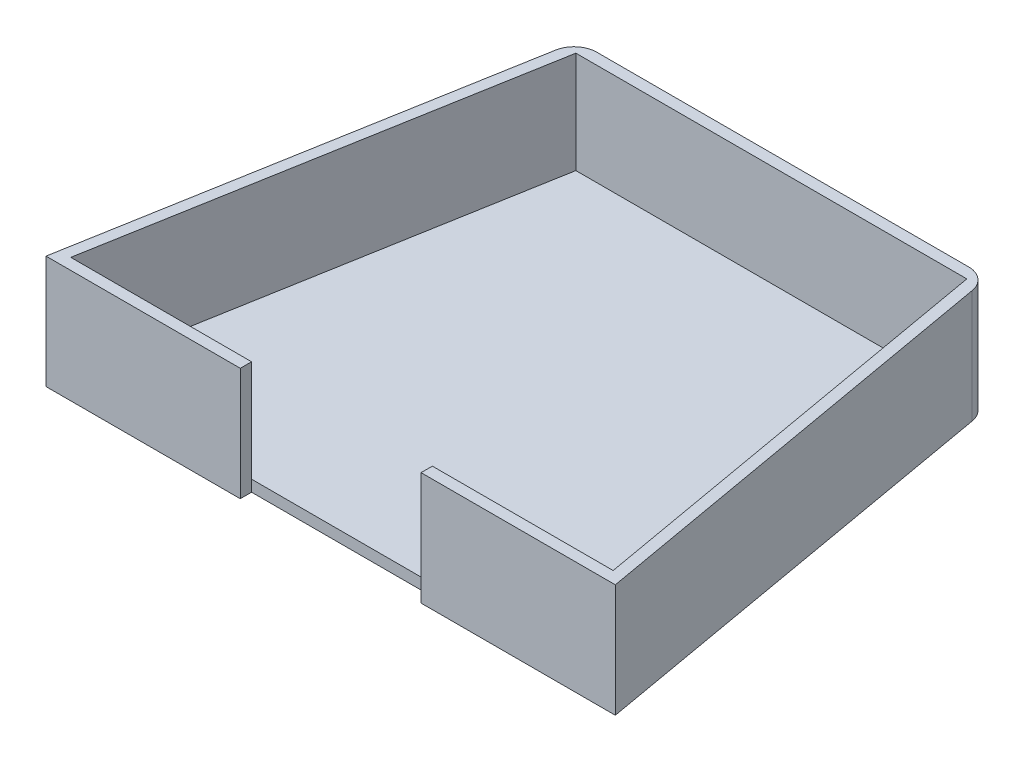
ISO-10303-21;
HEADER;
FILE_DESCRIPTION(('STEP AP214'),'2;1');
FILE_NAME('part.step','',(''),(''),'','','');
FILE_SCHEMA(('AUTOMOTIVE_DESIGN { 1 0 10303 214 1 1 1 1 }'));
ENDSEC;
DATA;
#1=APPLICATION_CONTEXT('core data for automotive mechanical design processes');
#2=APPLICATION_PROTOCOL_DEFINITION('international standard','automotive_design',2000,#1);
#3=PRODUCT_CONTEXT('',#1,'mechanical');
#4=PRODUCT('Part','Part','',(#3));
#5=PRODUCT_RELATED_PRODUCT_CATEGORY('part','',(#4));
#6=PRODUCT_DEFINITION_FORMATION('','',#4);
#7=PRODUCT_DEFINITION_CONTEXT('part definition',#1,'design');
#8=PRODUCT_DEFINITION('design','',#6,#7);
#9=PRODUCT_DEFINITION_SHAPE('','',#8);
#10=(LENGTH_UNIT() NAMED_UNIT(*) SI_UNIT(.MILLI.,.METRE.));
#11=(NAMED_UNIT(*) PLANE_ANGLE_UNIT() SI_UNIT($,.RADIAN.));
#12=(NAMED_UNIT(*) SI_UNIT($,.STERADIAN.) SOLID_ANGLE_UNIT());
#13=UNCERTAINTY_MEASURE_WITH_UNIT(LENGTH_MEASURE(1.E-05),#10,'distance_accuracy_value','');
#14=(GEOMETRIC_REPRESENTATION_CONTEXT(3) GLOBAL_UNCERTAINTY_ASSIGNED_CONTEXT((#13)) GLOBAL_UNIT_ASSIGNED_CONTEXT((#10,
#11,#12)) REPRESENTATION_CONTEXT('',''));
#15=CARTESIAN_POINT('',(0.,0.,0.));
#16=DIRECTION('',(0.,0.,1.));
#17=DIRECTION('',(1.,0.,0.));
#18=AXIS2_PLACEMENT_3D('',#15,#16,#17);
#19=CARTESIAN_POINT('',(240.,5.,0.));
#20=DIRECTION('',(0.,0.,-1.));
#21=DIRECTION('',(-1.,0.,0.));
#22=AXIS2_PLACEMENT_3D('',#19,#20,#21);
#23=PLANE('',#22);
#24=DIRECTION('',(0.,-1.,0.));
#25=VECTOR('',#24,1.);
#26=CARTESIAN_POINT('',(240.,5.,0.));
#27=LINE('',#26,#25);
#28=CARTESIAN_POINT('',(240.,5.,0.));
#29=VERTEX_POINT('',#28);
#30=CARTESIAN_POINT('',(240.,0.,0.));
#31=VERTEX_POINT('',#30);
#32=EDGE_CURVE('E13',#29,#31,#27,.T.);
#33=ORIENTED_EDGE('',*,*,#32,.F.);
#34=DIRECTION('',(1.,0.,0.));
#35=VECTOR('',#34,1.);
#36=CARTESIAN_POINT('',(240.,5.,0.));
#37=LINE('',#36,#35);
#38=CARTESIAN_POINT('',(0.,5.,0.));
#39=VERTEX_POINT('',#38);
#40=EDGE_CURVE('E123',#39,#29,#37,.T.);
#41=ORIENTED_EDGE('',*,*,#40,.F.);
#42=DIRECTION('',(0.,-1.,0.));
#43=VECTOR('',#42,1.);
#44=CARTESIAN_POINT('',(0.,5.,0.));
#45=LINE('',#44,#43);
#46=CARTESIAN_POINT('',(0.,0.,0.));
#47=VERTEX_POINT('',#46);
#48=EDGE_CURVE('E143',#39,#47,#45,.T.);
#49=ORIENTED_EDGE('',*,*,#48,.T.);
#50=DIRECTION('',(1.,0.,0.));
#51=VECTOR('',#50,1.);
#52=CARTESIAN_POINT('',(240.,0.,0.));
#53=LINE('',#52,#51);
#54=EDGE_CURVE('E147',#47,#31,#53,.T.);
#55=ORIENTED_EDGE('',*,*,#54,.T.);
#56=EDGE_LOOP('',(#33,#41,#49,#55));
#57=FACE_BOUND('',#56,.T.);
#58=ADVANCED_FACE('F78',(#57),#23,.F.);
#59=CARTESIAN_POINT('',(206.497873665391,5.,-190.));
#60=DIRECTION('',(-0.984807753012207,0.,0.173648177666935));
#61=DIRECTION('',(0.173648177666935,0.,0.984807753012207));
#62=AXIS2_PLACEMENT_3D('',#59,#60,#61);
#63=PLANE('',#62);
#64=DIRECTION('',(-0.173648177666935,0.,-0.984807753012207));
#65=VECTOR('',#64,1.);
#66=CARTESIAN_POINT('',(206.497873665391,0.,-190.));
#67=LINE('',#66,#65);
#68=CARTESIAN_POINT('',(206.497873665391,0.,-190.));
#69=VERTEX_POINT('',#68);
#70=EDGE_CURVE('E136',#31,#69,#67,.T.);
#71=ORIENTED_EDGE('',*,*,#70,.T.);
#72=DIRECTION('',(0.,-1.,0.));
#73=VECTOR('',#72,1.);
#74=CARTESIAN_POINT('',(206.497873665391,5.,-190.));
#75=LINE('',#74,#73);
#76=CARTESIAN_POINT('',(206.497873665391,5.,-190.));
#77=VERTEX_POINT('',#76);
#78=EDGE_CURVE('E87',#77,#69,#75,.T.);
#79=ORIENTED_EDGE('',*,*,#78,.F.);
#80=DIRECTION('',(-0.173648177666935,0.,-0.984807753012207));
#81=VECTOR('',#80,1.);
#82=CARTESIAN_POINT('',(206.497873665391,5.,-190.));
#83=LINE('',#82,#81);
#84=EDGE_CURVE('E125',#29,#77,#83,.T.);
#85=ORIENTED_EDGE('',*,*,#84,.F.);
#86=ORIENTED_EDGE('',*,*,#32,.T.);
#87=EDGE_LOOP('',(#71,#79,#85,#86));
#88=FACE_BOUND('',#87,.T.);
#89=ADVANCED_FACE('F134',(#88),#63,.F.);
#90=CARTESIAN_POINT('',(33.5021263346091,5.,-190.));
#91=DIRECTION('',(0.,0.,1.));
#92=DIRECTION('',(1.,0.,0.));
#93=AXIS2_PLACEMENT_3D('',#90,#91,#92);
#94=PLANE('',#93);
#95=DIRECTION('',(-1.,0.,0.));
#96=VECTOR('',#95,1.);
#97=CARTESIAN_POINT('',(33.5021263346091,0.,-190.));
#98=LINE('',#97,#96);
#99=CARTESIAN_POINT('',(33.5021263346091,0.,-190.));
#100=VERTEX_POINT('',#99);
#101=EDGE_CURVE('E112',#69,#100,#98,.T.);
#102=ORIENTED_EDGE('',*,*,#101,.T.);
#103=DIRECTION('',(0.,-1.,0.));
#104=VECTOR('',#103,1.);
#105=CARTESIAN_POINT('',(33.5021263346091,5.,-190.));
#106=LINE('',#105,#104);
#107=CARTESIAN_POINT('',(33.5021263346091,5.,-190.));
#108=VERTEX_POINT('',#107);
#109=EDGE_CURVE('E138',#108,#100,#106,.T.);
#110=ORIENTED_EDGE('',*,*,#109,.F.);
#111=DIRECTION('',(-1.,0.,0.));
#112=VECTOR('',#111,1.);
#113=CARTESIAN_POINT('',(33.5021263346091,5.,-190.));
#114=LINE('',#113,#112);
#115=EDGE_CURVE('E129',#77,#108,#114,.T.);
#116=ORIENTED_EDGE('',*,*,#115,.F.);
#117=ORIENTED_EDGE('',*,*,#78,.T.);
#118=EDGE_LOOP('',(#102,#110,#116,#117));
#119=FACE_BOUND('',#118,.T.);
#120=ADVANCED_FACE('F139',(#119),#94,.F.);
#121=CARTESIAN_POINT('',(0.,5.,0.));
#122=DIRECTION('',(0.984807753012207,0.,0.173648177666934));
#123=DIRECTION('',(0.173648177666934,0.,-0.984807753012208));
#124=AXIS2_PLACEMENT_3D('',#121,#122,#123);
#125=PLANE('',#124);
#126=DIRECTION('',(-0.173648177666934,0.,0.984807753012207));
#127=VECTOR('',#126,1.);
#128=CARTESIAN_POINT('',(0.,0.,0.));
#129=LINE('',#128,#127);
#130=EDGE_CURVE('E118',#100,#47,#129,.T.);
#131=ORIENTED_EDGE('',*,*,#130,.T.);
#132=ORIENTED_EDGE('',*,*,#48,.F.);
#133=DIRECTION('',(-0.173648177666934,0.,0.984807753012207));
#134=VECTOR('',#133,1.);
#135=CARTESIAN_POINT('',(0.,5.,0.));
#136=LINE('',#135,#134);
#137=EDGE_CURVE('E95',#108,#39,#136,.T.);
#138=ORIENTED_EDGE('',*,*,#137,.F.);
#139=ORIENTED_EDGE('',*,*,#109,.T.);
#140=EDGE_LOOP('',(#131,#132,#138,#139));
#141=FACE_BOUND('',#140,.T.);
#142=ADVANCED_FACE('F159',(#141),#125,.F.);
#143=CARTESIAN_POINT('',(0.,5.,0.));
#144=DIRECTION('',(0.,-1.,0.));
#145=DIRECTION('',(0.,0.,-1.));
#146=AXIS2_PLACEMENT_3D('',#143,#144,#145);
#147=PLANE('',#146);
#148=ORIENTED_EDGE('',*,*,#40,.T.);
#149=ORIENTED_EDGE('',*,*,#84,.T.);
#150=ORIENTED_EDGE('',*,*,#115,.T.);
#151=ORIENTED_EDGE('',*,*,#137,.T.);
#152=EDGE_LOOP('',(#148,#149,#150,#151));
#153=FACE_BOUND('',#152,.T.);
#154=ADVANCED_FACE('F127',(#153),#147,.F.);
#155=CARTESIAN_POINT('',(0.,0.,0.));
#156=DIRECTION('',(0.,-1.,0.));
#157=DIRECTION('',(0.,0.,-1.));
#158=AXIS2_PLACEMENT_3D('',#155,#156,#157);
#159=PLANE('',#158);
#160=ORIENTED_EDGE('',*,*,#54,.F.);
#161=ORIENTED_EDGE('',*,*,#130,.F.);
#162=ORIENTED_EDGE('',*,*,#101,.F.);
#163=ORIENTED_EDGE('',*,*,#70,.F.);
#164=EDGE_LOOP('',(#160,#161,#162,#163));
#165=FACE_BOUND('',#164,.T.);
#166=ADVANCED_FACE('F162',(#165),#159,.T.);
#167=CLOSED_SHELL('',(#58,#89,#120,#142,#154,#166));
#168=MANIFOLD_SOLID_BREP('B2',#167);
#169=CARTESIAN_POINT('',(0.,50.,5.));
#170=DIRECTION('',(0.,0.,1.));
#171=DIRECTION('',(1.,0.,0.));
#172=AXIS2_PLACEMENT_3D('',#169,#170,#171);
#173=PLANE('',#172);
#174=DIRECTION('',(-1.,0.,0.));
#175=VECTOR('',#174,1.);
#176=CARTESIAN_POINT('',(0.,50.,5.));
#177=LINE('',#176,#175);
#178=CARTESIAN_POINT('',(245.958767962971,50.,4.99999999999998));
#179=VERTEX_POINT('',#178);
#180=CARTESIAN_POINT('',(160.,50.,5.));
#181=VERTEX_POINT('',#180);
#182=EDGE_CURVE('E356',#179,#181,#177,.T.);
#183=ORIENTED_EDGE('',*,*,#182,.T.);
#184=DIRECTION('',(0.,-1.,0.));
#185=VECTOR('',#184,1.);
#186=CARTESIAN_POINT('',(160.,0.,5.));
#187=LINE('',#186,#185);
#188=CARTESIAN_POINT('',(160.,0.,5.));
#189=VERTEX_POINT('',#188);
#190=EDGE_CURVE('E412',#181,#189,#187,.T.);
#191=ORIENTED_EDGE('',*,*,#190,.T.);
#192=DIRECTION('',(-1.,0.,0.));
#193=VECTOR('',#192,1.);
#194=CARTESIAN_POINT('',(0.,0.,5.));
#195=LINE('',#194,#193);
#196=CARTESIAN_POINT('',(245.958767962971,0.,4.99999999999998));
#197=VERTEX_POINT('',#196);
#198=EDGE_CURVE('E324',#197,#189,#195,.T.);
#199=ORIENTED_EDGE('',*,*,#198,.F.);
#200=DIRECTION('',(0.,-1.,0.));
#201=VECTOR('',#200,1.);
#202=CARTESIAN_POINT('',(245.958767962971,50.,4.99999999999998));
#203=LINE('',#202,#201);
#204=EDGE_CURVE('E365',#179,#197,#203,.T.);
#205=ORIENTED_EDGE('',*,*,#204,.F.);
#206=EDGE_LOOP('',(#183,#191,#199,#205));
#207=FACE_BOUND('',#206,.T.);
#208=ADVANCED_FACE('F207',(#207),#173,.T.);
#209=CARTESIAN_POINT('',(240.,50.,0.));
#210=DIRECTION('',(0.,0.,1.));
#211=DIRECTION('',(1.,0.,0.));
#212=AXIS2_PLACEMENT_3D('',#209,#210,#211);
#213=PLANE('',#212);
#214=DIRECTION('',(0.,-1.,0.));
#215=VECTOR('',#214,1.);
#216=CARTESIAN_POINT('',(160.,0.,0.));
#217=LINE('',#216,#215);
#218=CARTESIAN_POINT('',(160.,50.,0.));
#219=VERTEX_POINT('',#218);
#220=CARTESIAN_POINT('',(160.,0.,0.));
#221=VERTEX_POINT('',#220);
#222=EDGE_CURVE('E305',#219,#221,#217,.T.);
#223=ORIENTED_EDGE('',*,*,#222,.F.);
#224=DIRECTION('',(-1.,0.,0.));
#225=VECTOR('',#224,1.);
#226=CARTESIAN_POINT('',(240.,50.,0.));
#227=LINE('',#226,#225);
#228=CARTESIAN_POINT('',(240.,50.,0.));
#229=VERTEX_POINT('',#228);
#230=EDGE_CURVE('E424',#229,#219,#227,.T.);
#231=ORIENTED_EDGE('',*,*,#230,.F.);
#232=DIRECTION('',(0.,-1.,0.));
#233=VECTOR('',#232,1.);
#234=CARTESIAN_POINT('',(240.,50.,0.));
#235=LINE('',#234,#233);
#236=CARTESIAN_POINT('',(240.,0.,0.));
#237=VERTEX_POINT('',#236);
#238=EDGE_CURVE('E328',#229,#237,#235,.T.);
#239=ORIENTED_EDGE('',*,*,#238,.T.);
#240=DIRECTION('',(-1.,0.,0.));
#241=VECTOR('',#240,1.);
#242=CARTESIAN_POINT('',(240.,0.,0.));
#243=LINE('',#242,#241);
#244=EDGE_CURVE('E322',#237,#221,#243,.T.);
#245=ORIENTED_EDGE('',*,*,#244,.T.);
#246=EDGE_LOOP('',(#223,#231,#239,#245));
#247=FACE_BOUND('',#246,.T.);
#248=ADVANCED_FACE('F327',(#247),#213,.F.);
#249=CARTESIAN_POINT('',(237.68715325937,50.,-41.9106580874159));
#250=DIRECTION('',(0.984807753012207,0.,-0.173648177666935));
#251=DIRECTION('',(-0.173648177666935,0.,-0.984807753012207));
#252=AXIS2_PLACEMENT_3D('',#249,#250,#251);
#253=PLANE('',#252);
#254=DIRECTION('',(0.173648177666935,0.,0.984807753012207));
#255=VECTOR('',#254,1.);
#256=CARTESIAN_POINT('',(237.68715325937,0.,-41.9106580874159));
#257=LINE('',#256,#255);
#258=CARTESIAN_POINT('',(212.150453039626,0.,-186.736481776669));
#259=VERTEX_POINT('',#258);
#260=EDGE_CURVE('E344',#259,#197,#257,.T.);
#261=ORIENTED_EDGE('',*,*,#260,.F.);
#262=DIRECTION('',(0.,-1.,0.));
#263=VECTOR('',#262,1.);
#264=CARTESIAN_POINT('',(212.150453039626,50.,-186.736481776669));
#265=LINE('',#264,#263);
#266=CARTESIAN_POINT('',(212.150453039626,50.,-186.736481776669));
#267=VERTEX_POINT('',#266);
#268=EDGE_CURVE('E388',#259,#267,#265,.F.);
#269=ORIENTED_EDGE('',*,*,#268,.T.);
#270=DIRECTION('',(0.173648177666935,0.,0.984807753012207));
#271=VECTOR('',#270,1.);
#272=CARTESIAN_POINT('',(237.68715325937,50.,-41.9106580874159));
#273=LINE('',#272,#271);
#274=EDGE_CURVE('E352',#267,#179,#273,.T.);
#275=ORIENTED_EDGE('',*,*,#274,.T.);
#276=ORIENTED_EDGE('',*,*,#204,.T.);
#277=EDGE_LOOP('',(#261,#269,#275,#276));
#278=FACE_BOUND('',#277,.T.);
#279=ADVANCED_FACE('F409',(#278),#253,.T.);
#280=CARTESIAN_POINT('',(0.,50.,-195.));
#281=DIRECTION('',(0.,0.,-1.));
#282=DIRECTION('',(-1.,0.,0.));
#283=AXIS2_PLACEMENT_3D('',#280,#281,#282);
#284=PLANE('',#283);
#285=DIRECTION('',(1.,0.,0.));
#286=VECTOR('',#285,1.);
#287=CARTESIAN_POINT('',(0.,50.,-195.));
#288=LINE('',#287,#286);
#289=CARTESIAN_POINT('',(37.6976244904955,50.,-195.));
#290=VERTEX_POINT('',#289);
#291=CARTESIAN_POINT('',(202.302375509504,50.,-195.));
#292=VERTEX_POINT('',#291);
#293=EDGE_CURVE('E362',#290,#292,#288,.T.);
#294=ORIENTED_EDGE('',*,*,#293,.T.);
#295=DIRECTION('',(0.,-1.,0.));
#296=VECTOR('',#295,1.);
#297=CARTESIAN_POINT('',(202.302375509504,50.,-195.));
#298=LINE('',#297,#296);
#299=CARTESIAN_POINT('',(202.302375509504,0.,-195.));
#300=VERTEX_POINT('',#299);
#301=EDGE_CURVE('E381',#292,#300,#298,.T.);
#302=ORIENTED_EDGE('',*,*,#301,.T.);
#303=DIRECTION('',(1.,0.,0.));
#304=VECTOR('',#303,1.);
#305=CARTESIAN_POINT('',(0.,0.,-195.));
#306=LINE('',#305,#304);
#307=CARTESIAN_POINT('',(37.6976244904955,0.,-195.));
#308=VERTEX_POINT('',#307);
#309=EDGE_CURVE('E355',#308,#300,#306,.T.);
#310=ORIENTED_EDGE('',*,*,#309,.F.);
#311=DIRECTION('',(0.,-1.,0.));
#312=VECTOR('',#311,1.);
#313=CARTESIAN_POINT('',(37.6976244904955,50.,-195.));
#314=LINE('',#313,#312);
#315=EDGE_CURVE('E377',#308,#290,#314,.F.);
#316=ORIENTED_EDGE('',*,*,#315,.T.);
#317=EDGE_LOOP('',(#294,#302,#310,#316));
#318=FACE_BOUND('',#317,.T.);
#319=ADVANCED_FACE('F403',(#318),#284,.T.);
#320=CARTESIAN_POINT('',(-4.92403876506104,50.,-0.868240888334671));
#321=DIRECTION('',(-0.984807753012207,0.,-0.173648177666934));
#322=DIRECTION('',(-0.173648177666934,0.,0.984807753012207));
#323=AXIS2_PLACEMENT_3D('',#320,#321,#322);
#324=PLANE('',#323);
#325=DIRECTION('',(0.173648177666934,0.,-0.984807753012208));
#326=VECTOR('',#325,1.);
#327=CARTESIAN_POINT('',(-4.92403876506104,50.,-0.868240888334671));
#328=LINE('',#327,#326);
#329=CARTESIAN_POINT('',(-5.95876796297107,50.,5.));
#330=VERTEX_POINT('',#329);
#331=CARTESIAN_POINT('',(27.8495469603734,50.,-186.736481776669));
#332=VERTEX_POINT('',#331);
#333=EDGE_CURVE('E359',#330,#332,#328,.T.);
#334=ORIENTED_EDGE('',*,*,#333,.T.);
#335=DIRECTION('',(0.,-1.,0.));
#336=VECTOR('',#335,1.);
#337=CARTESIAN_POINT('',(27.8495469603734,50.,-186.736481776669));
#338=LINE('',#337,#336);
#339=CARTESIAN_POINT('',(27.8495469603734,0.,-186.736481776669));
#340=VERTEX_POINT('',#339);
#341=EDGE_CURVE('E76',#332,#340,#338,.T.);
#342=ORIENTED_EDGE('',*,*,#341,.T.);
#343=DIRECTION('',(0.173648177666934,0.,-0.984807753012208));
#344=VECTOR('',#343,1.);
#345=CARTESIAN_POINT('',(-4.92403876506104,0.,-0.868240888334671));
#346=LINE('',#345,#344);
#347=CARTESIAN_POINT('',(-5.95876796297107,0.,5.));
#348=VERTEX_POINT('',#347);
#349=EDGE_CURVE('E369',#348,#340,#346,.T.);
#350=ORIENTED_EDGE('',*,*,#349,.F.);
#351=DIRECTION('',(0.,-1.,0.));
#352=VECTOR('',#351,1.);
#353=CARTESIAN_POINT('',(-5.95876796297107,50.,5.));
#354=LINE('',#353,#352);
#355=EDGE_CURVE('E374',#330,#348,#354,.T.);
#356=ORIENTED_EDGE('',*,*,#355,.F.);
#357=EDGE_LOOP('',(#334,#342,#350,#356));
#358=FACE_BOUND('',#357,.T.);
#359=ADVANCED_FACE('F455',(#358),#324,.T.);
#360=DIRECTION('',(0.,-1.,0.));
#361=VECTOR('',#360,1.);
#362=CARTESIAN_POINT('',(80.,0.,5.));
#363=LINE('',#362,#361);
#364=CARTESIAN_POINT('',(80.,50.,5.));
#365=VERTEX_POINT('',#364);
#366=CARTESIAN_POINT('',(80.,0.,5.));
#367=VERTEX_POINT('',#366);
#368=EDGE_CURVE('E315',#365,#367,#363,.T.);
#369=ORIENTED_EDGE('',*,*,#368,.F.);
#370=EDGE_CURVE('E354',#365,#330,#177,.T.);
#371=ORIENTED_EDGE('',*,*,#370,.T.);
#372=ORIENTED_EDGE('',*,*,#355,.T.);
#373=EDGE_CURVE('E367',#367,#348,#195,.T.);
#374=ORIENTED_EDGE('',*,*,#373,.F.);
#375=EDGE_LOOP('',(#369,#371,#372,#374));
#376=FACE_BOUND('',#375,.T.);
#377=ADVANCED_FACE('F451',(#376),#173,.T.);
#378=CARTESIAN_POINT('',(0.,50.,0.));
#379=DIRECTION('',(0.,-1.,0.));
#380=DIRECTION('',(0.,0.,-1.));
#381=AXIS2_PLACEMENT_3D('',#378,#379,#380);
#382=PLANE('',#381);
#383=ORIENTED_EDGE('',*,*,#370,.F.);
#384=DIRECTION('',(0.,0.,1.));
#385=VECTOR('',#384,1.);
#386=CARTESIAN_POINT('',(80.,50.,0.));
#387=LINE('',#386,#385);
#388=CARTESIAN_POINT('',(80.,50.,0.));
#389=VERTEX_POINT('',#388);
#390=EDGE_CURVE('E418',#389,#365,#387,.T.);
#391=ORIENTED_EDGE('',*,*,#390,.F.);
#392=CARTESIAN_POINT('',(0.,50.,0.));
#393=VERTEX_POINT('',#392);
#394=EDGE_CURVE('E423',#389,#393,#227,.T.);
#395=ORIENTED_EDGE('',*,*,#394,.T.);
#396=DIRECTION('',(0.173648177666934,0.,-0.984807753012207));
#397=VECTOR('',#396,1.);
#398=CARTESIAN_POINT('',(0.,50.,0.));
#399=LINE('',#398,#397);
#400=CARTESIAN_POINT('',(33.5021263346091,50.,-190.));
#401=VERTEX_POINT('',#400);
#402=EDGE_CURVE('E426',#393,#401,#399,.T.);
#403=ORIENTED_EDGE('',*,*,#402,.T.);
#404=DIRECTION('',(1.,0.,0.));
#405=VECTOR('',#404,1.);
#406=CARTESIAN_POINT('',(33.5021263346091,50.,-190.));
#407=LINE('',#406,#405);
#408=CARTESIAN_POINT('',(206.497873665391,50.,-190.));
#409=VERTEX_POINT('',#408);
#410=EDGE_CURVE('E351',#401,#409,#407,.T.);
#411=ORIENTED_EDGE('',*,*,#410,.T.);
#412=DIRECTION('',(0.173648177666935,0.,0.984807753012207));
#413=VECTOR('',#412,1.);
#414=CARTESIAN_POINT('',(206.497873665391,50.,-190.));
#415=LINE('',#414,#413);
#416=EDGE_CURVE('E341',#409,#229,#415,.T.);
#417=ORIENTED_EDGE('',*,*,#416,.T.);
#418=ORIENTED_EDGE('',*,*,#230,.T.);
#419=DIRECTION('',(0.,0.,1.));
#420=VECTOR('',#419,1.);
#421=CARTESIAN_POINT('',(160.,50.,0.));
#422=LINE('',#421,#420);
#423=EDGE_CURVE('E222',#219,#181,#422,.T.);
#424=ORIENTED_EDGE('',*,*,#423,.T.);
#425=ORIENTED_EDGE('',*,*,#182,.F.);
#426=ORIENTED_EDGE('',*,*,#274,.F.);
#427=CARTESIAN_POINT('',(202.302375509504,50.,-185.));
#428=DIRECTION('',(0.,-1.,0.));
#429=DIRECTION('',(0.,0.,-1.));
#430=AXIS2_PLACEMENT_3D('',#427,#428,#429);
#431=CIRCLE('',#430,10.);
#432=EDGE_CURVE('E215',#267,#292,#431,.F.);
#433=ORIENTED_EDGE('',*,*,#432,.T.);
#434=ORIENTED_EDGE('',*,*,#293,.F.);
#435=CARTESIAN_POINT('',(37.6976244904955,50.,-185.));
#436=DIRECTION('',(0.,-1.,0.));
#437=DIRECTION('',(0.,0.,-1.));
#438=AXIS2_PLACEMENT_3D('',#435,#436,#437);
#439=CIRCLE('',#438,10.);
#440=EDGE_CURVE('E390',#290,#332,#439,.F.);
#441=ORIENTED_EDGE('',*,*,#440,.T.);
#442=ORIENTED_EDGE('',*,*,#333,.F.);
#443=EDGE_LOOP('',(#383,#391,#395,#403,#411,#417,#418,#424,#425,#426,#433,#434,#441,#442));
#444=FACE_BOUND('',#443,.T.);
#445=ADVANCED_FACE('F396',(#444),#382,.F.);
#446=CARTESIAN_POINT('',(0.,0.,0.));
#447=DIRECTION('',(0.,-1.,0.));
#448=DIRECTION('',(0.,0.,-1.));
#449=AXIS2_PLACEMENT_3D('',#446,#447,#448);
#450=PLANE('',#449);
#451=DIRECTION('',(0.,0.,1.));
#452=VECTOR('',#451,1.);
#453=CARTESIAN_POINT('',(80.,0.,0.));
#454=LINE('',#453,#452);
#455=CARTESIAN_POINT('',(80.,0.,0.));
#456=VERTEX_POINT('',#455);
#457=EDGE_CURVE('E230',#456,#367,#454,.T.);
#458=ORIENTED_EDGE('',*,*,#457,.T.);
#459=ORIENTED_EDGE('',*,*,#373,.T.);
#460=ORIENTED_EDGE('',*,*,#349,.T.);
#461=CARTESIAN_POINT('',(37.6976244904955,0.,-185.));
#462=DIRECTION('',(0.,-1.,0.));
#463=DIRECTION('',(0.,0.,-1.));
#464=AXIS2_PLACEMENT_3D('',#461,#462,#463);
#465=CIRCLE('',#464,10.);
#466=EDGE_CURVE('E384',#340,#308,#465,.T.);
#467=ORIENTED_EDGE('',*,*,#466,.T.);
#468=ORIENTED_EDGE('',*,*,#309,.T.);
#469=CARTESIAN_POINT('',(202.302375509504,0.,-185.));
#470=DIRECTION('',(0.,-1.,0.));
#471=DIRECTION('',(0.,0.,-1.));
#472=AXIS2_PLACEMENT_3D('',#469,#470,#471);
#473=CIRCLE('',#472,10.);
#474=EDGE_CURVE('E386',#300,#259,#473,.T.);
#475=ORIENTED_EDGE('',*,*,#474,.T.);
#476=ORIENTED_EDGE('',*,*,#260,.T.);
#477=ORIENTED_EDGE('',*,*,#198,.T.);
#478=DIRECTION('',(0.,0.,1.));
#479=VECTOR('',#478,1.);
#480=CARTESIAN_POINT('',(160.,0.,0.));
#481=LINE('',#480,#479);
#482=EDGE_CURVE('E308',#221,#189,#481,.T.);
#483=ORIENTED_EDGE('',*,*,#482,.F.);
#484=ORIENTED_EDGE('',*,*,#244,.F.);
#485=DIRECTION('',(0.173648177666935,0.,0.984807753012207));
#486=VECTOR('',#485,1.);
#487=CARTESIAN_POINT('',(206.497873665391,0.,-190.));
#488=LINE('',#487,#486);
#489=CARTESIAN_POINT('',(206.497873665391,0.,-190.));
#490=VERTEX_POINT('',#489);
#491=EDGE_CURVE('E335',#490,#237,#488,.T.);
#492=ORIENTED_EDGE('',*,*,#491,.F.);
#493=DIRECTION('',(1.,0.,0.));
#494=VECTOR('',#493,1.);
#495=CARTESIAN_POINT('',(33.5021263346091,0.,-190.));
#496=LINE('',#495,#494);
#497=CARTESIAN_POINT('',(33.5021263346091,0.,-190.));
#498=VERTEX_POINT('',#497);
#499=EDGE_CURVE('E333',#498,#490,#496,.T.);
#500=ORIENTED_EDGE('',*,*,#499,.F.);
#501=DIRECTION('',(0.173648177666934,0.,-0.984807753012207));
#502=VECTOR('',#501,1.);
#503=CARTESIAN_POINT('',(0.,0.,0.));
#504=LINE('',#503,#502);
#505=CARTESIAN_POINT('',(0.,0.,0.));
#506=VERTEX_POINT('',#505);
#507=EDGE_CURVE('E329',#506,#498,#504,.T.);
#508=ORIENTED_EDGE('',*,*,#507,.F.);
#509=EDGE_CURVE('E330',#456,#506,#243,.T.);
#510=ORIENTED_EDGE('',*,*,#509,.F.);
#511=EDGE_LOOP('',(#458,#459,#460,#467,#468,#475,#476,#477,#483,#484,#492,#500,#508,#510));
#512=FACE_BOUND('',#511,.T.);
#513=ADVANCED_FACE('F320',(#512),#450,.T.);
#514=CARTESIAN_POINT('',(206.497873665391,50.,-190.));
#515=DIRECTION('',(0.984807753012207,0.,-0.173648177666935));
#516=DIRECTION('',(-0.173648177666935,0.,-0.984807753012207));
#517=AXIS2_PLACEMENT_3D('',#514,#515,#516);
#518=PLANE('',#517);
#519=ORIENTED_EDGE('',*,*,#491,.T.);
#520=ORIENTED_EDGE('',*,*,#238,.F.);
#521=ORIENTED_EDGE('',*,*,#416,.F.);
#522=DIRECTION('',(0.,-1.,0.));
#523=VECTOR('',#522,1.);
#524=CARTESIAN_POINT('',(206.497873665391,50.,-190.));
#525=LINE('',#524,#523);
#526=EDGE_CURVE('E342',#409,#490,#525,.T.);
#527=ORIENTED_EDGE('',*,*,#526,.T.);
#528=EDGE_LOOP('',(#519,#520,#521,#527));
#529=FACE_BOUND('',#528,.T.);
#530=ADVANCED_FACE('F436',(#529),#518,.F.);
#531=CARTESIAN_POINT('',(33.5021263346091,50.,-190.));
#532=DIRECTION('',(0.,0.,-1.));
#533=DIRECTION('',(-1.,0.,0.));
#534=AXIS2_PLACEMENT_3D('',#531,#532,#533);
#535=PLANE('',#534);
#536=ORIENTED_EDGE('',*,*,#499,.T.);
#537=ORIENTED_EDGE('',*,*,#526,.F.);
#538=ORIENTED_EDGE('',*,*,#410,.F.);
#539=DIRECTION('',(0.,-1.,0.));
#540=VECTOR('',#539,1.);
#541=CARTESIAN_POINT('',(33.5021263346091,50.,-190.));
#542=LINE('',#541,#540);
#543=EDGE_CURVE('E345',#401,#498,#542,.T.);
#544=ORIENTED_EDGE('',*,*,#543,.T.);
#545=EDGE_LOOP('',(#536,#537,#538,#544));
#546=FACE_BOUND('',#545,.T.);
#547=ADVANCED_FACE('F433',(#546),#535,.F.);
#548=CARTESIAN_POINT('',(0.,50.,0.));
#549=DIRECTION('',(-0.984807753012207,0.,-0.173648177666934));
#550=DIRECTION('',(-0.173648177666934,0.,0.984807753012208));
#551=AXIS2_PLACEMENT_3D('',#548,#549,#550);
#552=PLANE('',#551);
#553=ORIENTED_EDGE('',*,*,#507,.T.);
#554=ORIENTED_EDGE('',*,*,#543,.F.);
#555=ORIENTED_EDGE('',*,*,#402,.F.);
#556=DIRECTION('',(0.,-1.,0.));
#557=VECTOR('',#556,1.);
#558=CARTESIAN_POINT('',(0.,50.,0.));
#559=LINE('',#558,#557);
#560=EDGE_CURVE('E347',#393,#506,#559,.T.);
#561=ORIENTED_EDGE('',*,*,#560,.T.);
#562=EDGE_LOOP('',(#553,#554,#555,#561));
#563=FACE_BOUND('',#562,.T.);
#564=ADVANCED_FACE('F440',(#563),#552,.F.);
#565=ORIENTED_EDGE('',*,*,#394,.F.);
#566=DIRECTION('',(0.,-1.,0.));
#567=VECTOR('',#566,1.);
#568=CARTESIAN_POINT('',(80.,0.,0.));
#569=LINE('',#568,#567);
#570=EDGE_CURVE('E314',#389,#456,#569,.T.);
#571=ORIENTED_EDGE('',*,*,#570,.T.);
#572=ORIENTED_EDGE('',*,*,#509,.T.);
#573=ORIENTED_EDGE('',*,*,#560,.F.);
#574=EDGE_LOOP('',(#565,#571,#572,#573));
#575=FACE_BOUND('',#574,.T.);
#576=ADVANCED_FACE('F444',(#575),#213,.F.);
#577=CARTESIAN_POINT('',(202.302375509504,50.,-185.));
#578=DIRECTION('',(0.,-1.,0.));
#579=DIRECTION('',(0.,0.,-1.));
#580=AXIS2_PLACEMENT_3D('',#577,#578,#579);
#581=CYLINDRICAL_SURFACE('',#580,10.);
#582=ORIENTED_EDGE('',*,*,#432,.F.);
#583=ORIENTED_EDGE('',*,*,#268,.F.);
#584=ORIENTED_EDGE('',*,*,#474,.F.);
#585=ORIENTED_EDGE('',*,*,#301,.F.);
#586=EDGE_LOOP('',(#582,#583,#584,#585));
#587=FACE_BOUND('',#586,.T.);
#588=ADVANCED_FACE('F406',(#587),#581,.T.);
#589=CARTESIAN_POINT('',(37.6976244904955,50.,-185.));
#590=DIRECTION('',(0.,-1.,0.));
#591=DIRECTION('',(0.,0.,-1.));
#592=AXIS2_PLACEMENT_3D('',#589,#590,#591);
#593=CYLINDRICAL_SURFACE('',#592,10.);
#594=ORIENTED_EDGE('',*,*,#440,.F.);
#595=ORIENTED_EDGE('',*,*,#315,.F.);
#596=ORIENTED_EDGE('',*,*,#466,.F.);
#597=ORIENTED_EDGE('',*,*,#341,.F.);
#598=EDGE_LOOP('',(#594,#595,#596,#597));
#599=FACE_BOUND('',#598,.T.);
#600=ADVANCED_FACE('F209',(#599),#593,.T.);
#601=CARTESIAN_POINT('',(160.,0.,0.));
#602=DIRECTION('',(-1.,0.,0.));
#603=DIRECTION('',(0.,0.,1.));
#604=AXIS2_PLACEMENT_3D('',#601,#602,#603);
#605=PLANE('',#604);
#606=ORIENTED_EDGE('',*,*,#190,.F.);
#607=ORIENTED_EDGE('',*,*,#423,.F.);
#608=ORIENTED_EDGE('',*,*,#222,.T.);
#609=ORIENTED_EDGE('',*,*,#482,.T.);
#610=EDGE_LOOP('',(#606,#607,#608,#609));
#611=FACE_BOUND('',#610,.T.);
#612=ADVANCED_FACE('F307',(#611),#605,.T.);
#613=CARTESIAN_POINT('',(80.,0.,0.));
#614=DIRECTION('',(-1.,0.,0.));
#615=DIRECTION('',(0.,0.,1.));
#616=AXIS2_PLACEMENT_3D('',#613,#614,#615);
#617=PLANE('',#616);
#618=ORIENTED_EDGE('',*,*,#368,.T.);
#619=ORIENTED_EDGE('',*,*,#457,.F.);
#620=ORIENTED_EDGE('',*,*,#570,.F.);
#621=ORIENTED_EDGE('',*,*,#390,.T.);
#622=EDGE_LOOP('',(#618,#619,#620,#621));
#623=FACE_BOUND('',#622,.T.);
#624=ADVANCED_FACE('F446',(#623),#617,.F.);
#625=CLOSED_SHELL('',(#208,#248,#279,#319,#359,#377,#445,#513,#530,#547,#564,#576,#588,#600,
#612,#624));
#626=MANIFOLD_SOLID_BREP('B7',#625);
#627=ADVANCED_BREP_SHAPE_REPRESENTATION('',(#18,#168,#626),#14);
#628=SHAPE_DEFINITION_REPRESENTATION(#9,#627);
ENDSEC;
END-ISO-10303-21;
